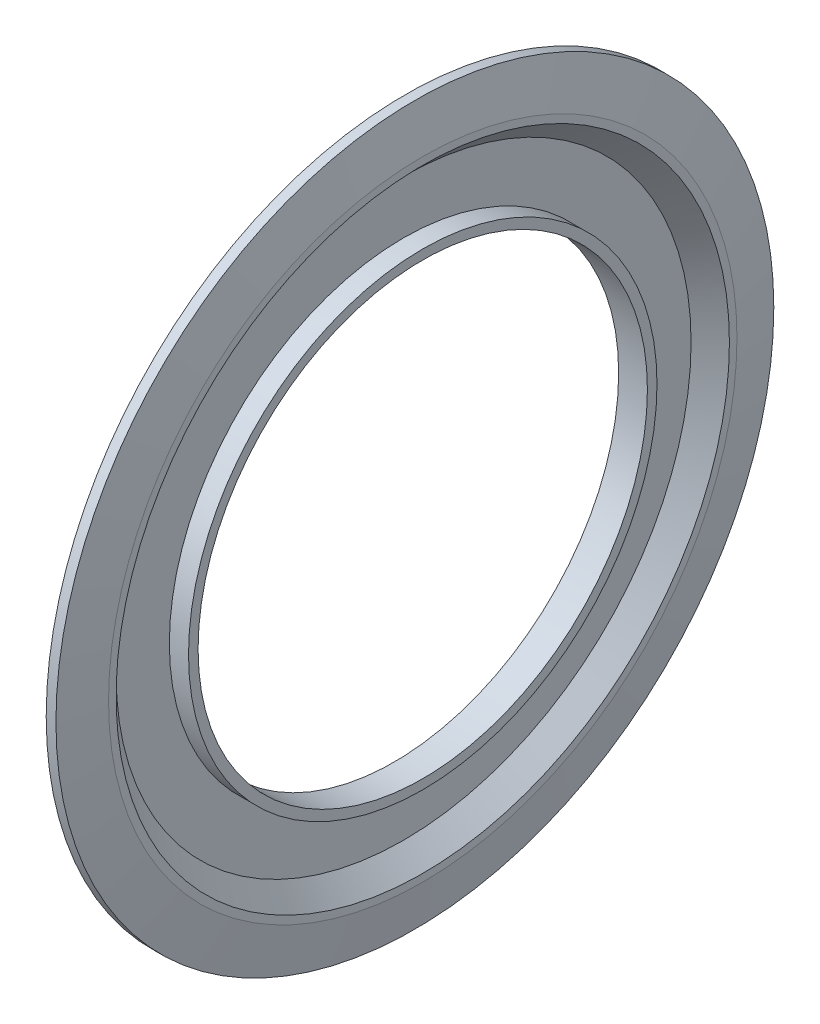
ISO-10303-21;
HEADER;
FILE_DESCRIPTION(('STEP AP214'),'2;1');
FILE_NAME('part.step','',(''),(''),'','','');
FILE_SCHEMA(('AUTOMOTIVE_DESIGN { 1 0 10303 214 1 1 1 1 }'));
ENDSEC;
DATA;
#1=APPLICATION_CONTEXT('core data for automotive mechanical design processes');
#2=APPLICATION_PROTOCOL_DEFINITION('international standard','automotive_design',2000,#1);
#3=PRODUCT_CONTEXT('',#1,'mechanical');
#4=PRODUCT('Part','Part','',(#3));
#5=PRODUCT_RELATED_PRODUCT_CATEGORY('part','',(#4));
#6=PRODUCT_DEFINITION_FORMATION('','',#4);
#7=PRODUCT_DEFINITION_CONTEXT('part definition',#1,'design');
#8=PRODUCT_DEFINITION('design','',#6,#7);
#9=PRODUCT_DEFINITION_SHAPE('','',#8);
#10=(LENGTH_UNIT() NAMED_UNIT(*) SI_UNIT(.MILLI.,.METRE.));
#11=(NAMED_UNIT(*) PLANE_ANGLE_UNIT() SI_UNIT($,.RADIAN.));
#12=(NAMED_UNIT(*) SI_UNIT($,.STERADIAN.) SOLID_ANGLE_UNIT());
#13=UNCERTAINTY_MEASURE_WITH_UNIT(LENGTH_MEASURE(1.E-05),#10,'distance_accuracy_value','');
#14=(GEOMETRIC_REPRESENTATION_CONTEXT(3) GLOBAL_UNCERTAINTY_ASSIGNED_CONTEXT((#13)) GLOBAL_UNIT_ASSIGNED_CONTEXT((#10,
#11,#12)) REPRESENTATION_CONTEXT('',''));
#15=CARTESIAN_POINT('',(0.,0.,0.));
#16=DIRECTION('',(0.,0.,1.));
#17=DIRECTION('',(1.,0.,0.));
#18=AXIS2_PLACEMENT_3D('',#15,#16,#17);
#19=CARTESIAN_POINT('',(0.715925388376828,0.,0.));
#20=DIRECTION('',(-1.,0.,0.));
#21=DIRECTION('',(0.,0.,1.));
#22=AXIS2_PLACEMENT_3D('',#19,#20,#21);
#23=CONICAL_SURFACE('',#22,6.,1.39626340159546);
#24=CARTESIAN_POINT('',(0.565342146851799,0.,0.));
#25=DIRECTION('',(1.,0.,0.));
#26=DIRECTION('',(0.,0.,-1.));
#27=AXIS2_PLACEMENT_3D('',#24,#25,#26);
#28=CIRCLE('',#27,6.854);
#29=CARTESIAN_POINT('',(0.5653421468518,0.,-6.854));
#30=VERTEX_POINT('',#29);
#31=EDGE_CURVE('E71',#30,#30,#28,.T.);
#32=ORIENTED_EDGE('',*,*,#31,.T.);
#33=EDGE_LOOP('',(#32));
#34=FACE_BOUND('',#33,.T.);
#35=CARTESIAN_POINT('',(0.715925388376828,0.,0.));
#36=DIRECTION('',(1.,0.,0.));
#37=DIRECTION('',(0.,0.,-1.));
#38=AXIS2_PLACEMENT_3D('',#35,#36,#37);
#39=CIRCLE('',#38,6.);
#40=CARTESIAN_POINT('',(0.715925388376829,0.,-6.));
#41=VERTEX_POINT('',#40);
#42=EDGE_CURVE('E10',#41,#41,#39,.T.);
#43=ORIENTED_EDGE('',*,*,#42,.F.);
#44=EDGE_LOOP('',(#43));
#45=FACE_BOUND('',#44,.T.);
#46=ADVANCED_FACE('F14',(#34,#45),#23,.T.);
#47=CARTESIAN_POINT('',(0.715925388376828,6.,0.));
#48=DIRECTION('',(-1.,0.,0.));
#49=DIRECTION('',(0.,0.,1.));
#50=AXIS2_PLACEMENT_3D('',#47,#48,#49);
#51=PLANE('',#50);
#52=CARTESIAN_POINT('',(0.715925388376828,0.,0.));
#53=DIRECTION('',(1.,0.,0.));
#54=DIRECTION('',(0.,0.,-1.));
#55=AXIS2_PLACEMENT_3D('',#52,#53,#54);
#56=CIRCLE('',#55,5.856);
#57=CARTESIAN_POINT('',(0.715925388376829,0.,-5.856));
#58=VERTEX_POINT('',#57);
#59=EDGE_CURVE('E21',#58,#58,#56,.T.);
#60=ORIENTED_EDGE('',*,*,#59,.F.);
#61=EDGE_LOOP('',(#60));
#62=FACE_BOUND('',#61,.T.);
#63=ORIENTED_EDGE('',*,*,#42,.T.);
#64=EDGE_LOOP('',(#63));
#65=FACE_BOUND('',#64,.T.);
#66=ADVANCED_FACE('F92',(#62,#65),#51,.F.);
#67=CARTESIAN_POINT('',(0.349925388376828,0.,0.));
#68=DIRECTION('',(1.,0.,0.));
#69=DIRECTION('',(0.,0.,-1.));
#70=AXIS2_PLACEMENT_3D('',#67,#68,#69);
#71=CONICAL_SURFACE('',#70,5.49,0.785398163397448);
#72=ORIENTED_EDGE('',*,*,#59,.T.);
#73=EDGE_LOOP('',(#72));
#74=FACE_BOUND('',#73,.T.);
#75=CARTESIAN_POINT('',(0.349925388376828,0.,0.));
#76=DIRECTION('',(1.,0.,0.));
#77=DIRECTION('',(0.,0.,-1.));
#78=AXIS2_PLACEMENT_3D('',#75,#76,#77);
#79=CIRCLE('',#78,5.49);
#80=CARTESIAN_POINT('',(0.349925388376829,0.,-5.49));
#81=VERTEX_POINT('',#80);
#82=EDGE_CURVE('E30',#81,#81,#79,.T.);
#83=ORIENTED_EDGE('',*,*,#82,.F.);
#84=EDGE_LOOP('',(#83));
#85=FACE_BOUND('',#84,.T.);
#86=ADVANCED_FACE('F96',(#74,#85),#71,.F.);
#87=CARTESIAN_POINT('',(0.349925388376827,4.473,0.));
#88=DIRECTION('',(1.,0.,0.));
#89=DIRECTION('',(0.,0.,-1.));
#90=AXIS2_PLACEMENT_3D('',#87,#88,#89);
#91=PLANE('',#90);
#92=ORIENTED_EDGE('',*,*,#82,.T.);
#93=EDGE_LOOP('',(#92));
#94=FACE_BOUND('',#93,.T.);
#95=CARTESIAN_POINT('',(0.349925388376827,0.,0.));
#96=DIRECTION('',(1.,0.,0.));
#97=DIRECTION('',(0.,0.,-1.));
#98=AXIS2_PLACEMENT_3D('',#95,#96,#97);
#99=CIRCLE('',#98,4.473);
#100=CARTESIAN_POINT('',(0.349925388376828,0.,-4.473));
#101=VERTEX_POINT('',#100);
#102=EDGE_CURVE('E37',#101,#101,#99,.T.);
#103=ORIENTED_EDGE('',*,*,#102,.F.);
#104=EDGE_LOOP('',(#103));
#105=FACE_BOUND('',#104,.T.);
#106=ADVANCED_FACE('F101',(#94,#105),#91,.T.);
#107=CARTESIAN_POINT('',(0.715925388376828,0.,0.));
#108=DIRECTION('',(1.,0.,0.));
#109=DIRECTION('',(0.,0.,-1.));
#110=AXIS2_PLACEMENT_3D('',#107,#108,#109);
#111=CYLINDRICAL_SURFACE('',#110,4.473);
#112=ORIENTED_EDGE('',*,*,#102,.T.);
#113=EDGE_LOOP('',(#112));
#114=FACE_BOUND('',#113,.T.);
#115=CARTESIAN_POINT('',(0.715925388376828,0.,0.));
#116=DIRECTION('',(1.,0.,0.));
#117=DIRECTION('',(0.,0.,-1.));
#118=AXIS2_PLACEMENT_3D('',#115,#116,#117);
#119=CIRCLE('',#118,4.473);
#120=CARTESIAN_POINT('',(0.715925388376829,0.,-4.473));
#121=VERTEX_POINT('',#120);
#122=EDGE_CURVE('E43',#121,#121,#119,.T.);
#123=ORIENTED_EDGE('',*,*,#122,.F.);
#124=EDGE_LOOP('',(#123));
#125=FACE_BOUND('',#124,.T.);
#126=ADVANCED_FACE('F106',(#114,#125),#111,.T.);
#127=CARTESIAN_POINT('',(0.715925388376828,4.29,0.));
#128=DIRECTION('',(1.,0.,0.));
#129=DIRECTION('',(0.,0.,-1.));
#130=AXIS2_PLACEMENT_3D('',#127,#128,#129);
#131=PLANE('',#130);
#132=ORIENTED_EDGE('',*,*,#122,.T.);
#133=EDGE_LOOP('',(#132));
#134=FACE_BOUND('',#133,.T.);
#135=CARTESIAN_POINT('',(0.715925388376828,0.,0.));
#136=DIRECTION('',(1.,0.,0.));
#137=DIRECTION('',(0.,0.,-1.));
#138=AXIS2_PLACEMENT_3D('',#135,#136,#137);
#139=CIRCLE('',#138,4.29);
#140=CARTESIAN_POINT('',(0.715925388376829,0.,-4.29));
#141=VERTEX_POINT('',#140);
#142=EDGE_CURVE('E47',#141,#141,#139,.T.);
#143=ORIENTED_EDGE('',*,*,#142,.F.);
#144=EDGE_LOOP('',(#143));
#145=FACE_BOUND('',#144,.T.);
#146=ADVANCED_FACE('F110',(#134,#145),#131,.T.);
#147=CARTESIAN_POINT('',(0.715925388376828,0.,0.));
#148=DIRECTION('',(1.,0.,0.));
#149=DIRECTION('',(0.,0.,-1.));
#150=AXIS2_PLACEMENT_3D('',#147,#148,#149);
#151=CYLINDRICAL_SURFACE('',#150,4.29);
#152=CARTESIAN_POINT('',(0.166925388376827,0.,0.));
#153=DIRECTION('',(1.,0.,0.));
#154=DIRECTION('',(0.,0.,-1.));
#155=AXIS2_PLACEMENT_3D('',#152,#153,#154);
#156=CIRCLE('',#155,4.29);
#157=CARTESIAN_POINT('',(0.166925388376828,0.,-4.29));
#158=VERTEX_POINT('',#157);
#159=EDGE_CURVE('E51',#158,#158,#156,.T.);
#160=ORIENTED_EDGE('',*,*,#159,.F.);
#161=EDGE_LOOP('',(#160));
#162=FACE_BOUND('',#161,.T.);
#163=ORIENTED_EDGE('',*,*,#142,.T.);
#164=EDGE_LOOP('',(#163));
#165=FACE_BOUND('',#164,.T.);
#166=ADVANCED_FACE('F114',(#162,#165),#151,.F.);
#167=CARTESIAN_POINT('',(0.166925388376827,4.29,0.));
#168=DIRECTION('',(1.,0.,0.));
#169=DIRECTION('',(0.,0.,-1.));
#170=AXIS2_PLACEMENT_3D('',#167,#168,#169);
#171=PLANE('',#170);
#172=CARTESIAN_POINT('',(0.166925388376828,0.,0.));
#173=DIRECTION('',(1.,0.,0.));
#174=DIRECTION('',(0.,0.,-1.));
#175=AXIS2_PLACEMENT_3D('',#172,#173,#174);
#176=CIRCLE('',#175,5.56580108191428);
#177=CARTESIAN_POINT('',(0.166925388376829,0.,-5.56580108191428));
#178=VERTEX_POINT('',#177);
#179=EDGE_CURVE('E55',#178,#178,#176,.T.);
#180=ORIENTED_EDGE('',*,*,#179,.F.);
#181=EDGE_LOOP('',(#180));
#182=FACE_BOUND('',#181,.T.);
#183=ORIENTED_EDGE('',*,*,#159,.T.);
#184=EDGE_LOOP('',(#183));
#185=FACE_BOUND('',#184,.T.);
#186=ADVANCED_FACE('F118',(#182,#185),#171,.F.);
#187=CARTESIAN_POINT('',(0.166925388376828,0.,0.));
#188=DIRECTION('',(1.,0.,0.));
#189=DIRECTION('',(0.,0.,-1.));
#190=AXIS2_PLACEMENT_3D('',#187,#188,#189);
#191=CONICAL_SURFACE('',#190,5.56580108191428,0.785398163397448);
#192=CARTESIAN_POINT('',(0.532925388376828,0.,0.));
#193=DIRECTION('',(1.,0.,0.));
#194=DIRECTION('',(0.,0.,-1.));
#195=AXIS2_PLACEMENT_3D('',#192,#193,#194);
#196=CIRCLE('',#195,5.93180108191428);
#197=CARTESIAN_POINT('',(0.532925388376829,0.,-5.93180108191428));
#198=VERTEX_POINT('',#197);
#199=EDGE_CURVE('E59',#198,#198,#196,.T.);
#200=ORIENTED_EDGE('',*,*,#199,.F.);
#201=EDGE_LOOP('',(#200));
#202=FACE_BOUND('',#201,.T.);
#203=ORIENTED_EDGE('',*,*,#179,.T.);
#204=EDGE_LOOP('',(#203));
#205=FACE_BOUND('',#204,.T.);
#206=ADVANCED_FACE('F122',(#202,#205),#191,.T.);
#207=CARTESIAN_POINT('',(0.532925388376828,5.93180108191428,0.));
#208=DIRECTION('',(1.,0.,0.));
#209=DIRECTION('',(0.,0.,-1.));
#210=AXIS2_PLACEMENT_3D('',#207,#208,#209);
#211=PLANE('',#210);
#212=CARTESIAN_POINT('',(0.532925388376828,0.,0.));
#213=DIRECTION('',(1.,0.,0.));
#214=DIRECTION('',(0.,0.,-1.));
#215=AXIS2_PLACEMENT_3D('',#212,#213,#214);
#216=CIRCLE('',#215,5.98398957457476);
#217=CARTESIAN_POINT('',(0.532925388376829,0.,-5.98398957457476));
#218=VERTEX_POINT('',#217);
#219=EDGE_CURVE('E63',#218,#218,#216,.T.);
#220=ORIENTED_EDGE('',*,*,#219,.F.);
#221=EDGE_LOOP('',(#220));
#222=FACE_BOUND('',#221,.T.);
#223=ORIENTED_EDGE('',*,*,#199,.T.);
#224=EDGE_LOOP('',(#223));
#225=FACE_BOUND('',#224,.T.);
#226=ADVANCED_FACE('F88',(#222,#225),#211,.F.);
#227=CARTESIAN_POINT('',(0.532925388376828,0.,0.));
#228=DIRECTION('',(-1.,0.,0.));
#229=DIRECTION('',(0.,0.,1.));
#230=AXIS2_PLACEMENT_3D('',#227,#228,#229);
#231=CONICAL_SURFACE('',#230,5.98398957457476,1.39626340159546);
#232=CARTESIAN_POINT('',(0.379519076876707,0.,0.));
#233=DIRECTION('',(1.,0.,0.));
#234=DIRECTION('',(0.,0.,-1.));
#235=AXIS2_PLACEMENT_3D('',#232,#233,#234);
#236=CIRCLE('',#235,6.854);
#237=CARTESIAN_POINT('',(0.379519076876708,0.,-6.854));
#238=VERTEX_POINT('',#237);
#239=EDGE_CURVE('E67',#238,#238,#236,.T.);
#240=ORIENTED_EDGE('',*,*,#239,.F.);
#241=EDGE_LOOP('',(#240));
#242=FACE_BOUND('',#241,.T.);
#243=ORIENTED_EDGE('',*,*,#219,.T.);
#244=EDGE_LOOP('',(#243));
#245=FACE_BOUND('',#244,.T.);
#246=ADVANCED_FACE('F81',(#242,#245),#231,.F.);
#247=CARTESIAN_POINT('',(0.715925388376828,0.,0.));
#248=DIRECTION('',(1.,0.,0.));
#249=DIRECTION('',(0.,0.,-1.));
#250=AXIS2_PLACEMENT_3D('',#247,#248,#249);
#251=CYLINDRICAL_SURFACE('',#250,6.854);
#252=ORIENTED_EDGE('',*,*,#239,.T.);
#253=EDGE_LOOP('',(#252));
#254=FACE_BOUND('',#253,.T.);
#255=ORIENTED_EDGE('',*,*,#31,.F.);
#256=EDGE_LOOP('',(#255));
#257=FACE_BOUND('',#256,.T.);
#258=ADVANCED_FACE('F79',(#254,#257),#251,.T.);
#259=CLOSED_SHELL('',(#46,#66,#86,#106,#126,#146,#166,#186,#206,#226,#246,#258));
#260=MANIFOLD_SOLID_BREP('B1',#259);
#261=ADVANCED_BREP_SHAPE_REPRESENTATION('',(#18,#260),#14);
#262=SHAPE_DEFINITION_REPRESENTATION(#9,#261);
ENDSEC;
END-ISO-10303-21;
